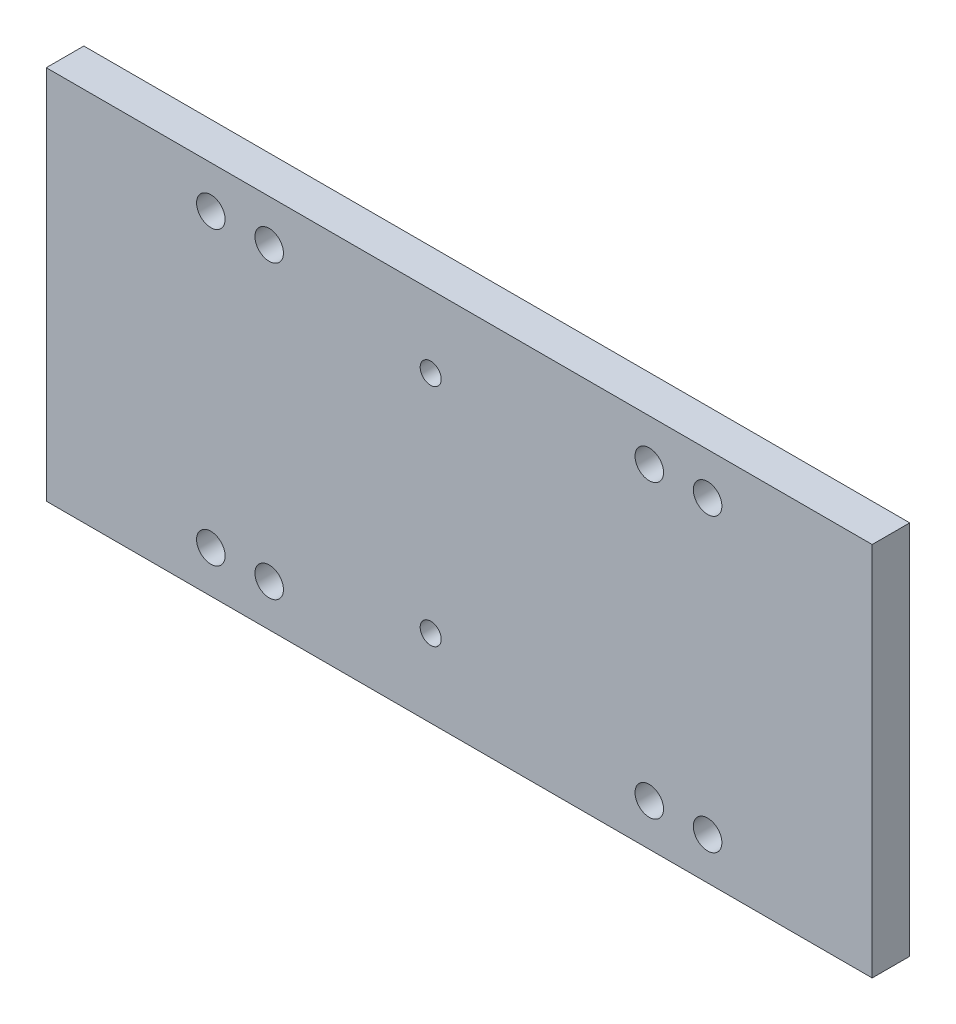
ISO-10303-21;
HEADER;
FILE_DESCRIPTION(('STEP AP214'),'2;1');
FILE_NAME('part.step','',(''),(''),'','','');
FILE_SCHEMA(('AUTOMOTIVE_DESIGN { 1 0 10303 214 1 1 1 1 }'));
ENDSEC;
DATA;
#1=APPLICATION_CONTEXT('core data for automotive mechanical design processes');
#2=APPLICATION_PROTOCOL_DEFINITION('international standard','automotive_design',2000,#1);
#3=PRODUCT_CONTEXT('',#1,'mechanical');
#4=PRODUCT('Part','Part','',(#3));
#5=PRODUCT_RELATED_PRODUCT_CATEGORY('part','',(#4));
#6=PRODUCT_DEFINITION_FORMATION('','',#4);
#7=PRODUCT_DEFINITION_CONTEXT('part definition',#1,'design');
#8=PRODUCT_DEFINITION('design','',#6,#7);
#9=PRODUCT_DEFINITION_SHAPE('','',#8);
#10=(LENGTH_UNIT() NAMED_UNIT(*) SI_UNIT(.MILLI.,.METRE.));
#11=(NAMED_UNIT(*) PLANE_ANGLE_UNIT() SI_UNIT($,.RADIAN.));
#12=(NAMED_UNIT(*) SI_UNIT($,.STERADIAN.) SOLID_ANGLE_UNIT());
#13=UNCERTAINTY_MEASURE_WITH_UNIT(LENGTH_MEASURE(1.E-05),#10,'distance_accuracy_value','');
#14=(GEOMETRIC_REPRESENTATION_CONTEXT(3) GLOBAL_UNCERTAINTY_ASSIGNED_CONTEXT((#13)) GLOBAL_UNIT_ASSIGNED_CONTEXT((#10,
#11,#12)) REPRESENTATION_CONTEXT('',''));
#15=CARTESIAN_POINT('',(0.,0.,0.));
#16=DIRECTION('',(0.,0.,1.));
#17=DIRECTION('',(1.,0.,0.));
#18=AXIS2_PLACEMENT_3D('',#15,#16,#17);
#19=CARTESIAN_POINT('',(0.,0.,6.35));
#20=DIRECTION('',(1.,0.,0.));
#21=DIRECTION('',(0.,0.,-1.));
#22=AXIS2_PLACEMENT_3D('',#19,#20,#21);
#23=PLANE('',#22);
#24=DIRECTION('',(0.,-1.,0.));
#25=VECTOR('',#24,1.);
#26=CARTESIAN_POINT('',(0.,0.,0.));
#27=LINE('',#26,#25);
#28=CARTESIAN_POINT('',(0.,63.5,0.));
#29=VERTEX_POINT('',#28);
#30=CARTESIAN_POINT('',(0.,0.,0.));
#31=VERTEX_POINT('',#30);
#32=EDGE_CURVE('E102',#29,#31,#27,.T.);
#33=ORIENTED_EDGE('',*,*,#32,.T.);
#34=DIRECTION('',(0.,0.,-1.));
#35=VECTOR('',#34,1.);
#36=CARTESIAN_POINT('',(0.,0.,6.35));
#37=LINE('',#36,#35);
#38=CARTESIAN_POINT('',(0.,0.,6.35));
#39=VERTEX_POINT('',#38);
#40=EDGE_CURVE('E11',#39,#31,#37,.T.);
#41=ORIENTED_EDGE('',*,*,#40,.F.);
#42=DIRECTION('',(0.,-1.,0.));
#43=VECTOR('',#42,1.);
#44=CARTESIAN_POINT('',(0.,0.,6.35));
#45=LINE('',#44,#43);
#46=CARTESIAN_POINT('',(0.,63.5,6.35));
#47=VERTEX_POINT('',#46);
#48=EDGE_CURVE('E90',#47,#39,#45,.T.);
#49=ORIENTED_EDGE('',*,*,#48,.F.);
#50=DIRECTION('',(0.,0.,-1.));
#51=VECTOR('',#50,1.);
#52=CARTESIAN_POINT('',(0.,63.5,6.35));
#53=LINE('',#52,#51);
#54=EDGE_CURVE('E98',#47,#29,#53,.T.);
#55=ORIENTED_EDGE('',*,*,#54,.T.);
#56=EDGE_LOOP('',(#33,#41,#49,#55));
#57=FACE_BOUND('',#56,.T.);
#58=ADVANCED_FACE('F39',(#57),#23,.F.);
#59=CARTESIAN_POINT('',(0.,0.,6.35));
#60=DIRECTION('',(0.,1.,0.));
#61=DIRECTION('',(0.,0.,1.));
#62=AXIS2_PLACEMENT_3D('',#59,#60,#61);
#63=PLANE('',#62);
#64=DIRECTION('',(1.,0.,0.));
#65=VECTOR('',#64,1.);
#66=CARTESIAN_POINT('',(0.,0.,0.));
#67=LINE('',#66,#65);
#68=CARTESIAN_POINT('',(139.7,0.,0.));
#69=VERTEX_POINT('',#68);
#70=EDGE_CURVE('E94',#31,#69,#67,.T.);
#71=ORIENTED_EDGE('',*,*,#70,.T.);
#72=DIRECTION('',(0.,0.,-1.));
#73=VECTOR('',#72,1.);
#74=CARTESIAN_POINT('',(139.7,0.,6.35));
#75=LINE('',#74,#73);
#76=CARTESIAN_POINT('',(139.7,0.,6.35));
#77=VERTEX_POINT('',#76);
#78=EDGE_CURVE('E47',#77,#69,#75,.T.);
#79=ORIENTED_EDGE('',*,*,#78,.F.);
#80=DIRECTION('',(1.,0.,0.));
#81=VECTOR('',#80,1.);
#82=CARTESIAN_POINT('',(0.,0.,6.35));
#83=LINE('',#82,#81);
#84=EDGE_CURVE('E85',#39,#77,#83,.T.);
#85=ORIENTED_EDGE('',*,*,#84,.F.);
#86=ORIENTED_EDGE('',*,*,#40,.T.);
#87=EDGE_LOOP('',(#71,#79,#85,#86));
#88=FACE_BOUND('',#87,.T.);
#89=ADVANCED_FACE('F93',(#88),#63,.F.);
#90=CARTESIAN_POINT('',(139.7,0.,6.35));
#91=DIRECTION('',(-1.,0.,0.));
#92=DIRECTION('',(0.,0.,1.));
#93=AXIS2_PLACEMENT_3D('',#90,#91,#92);
#94=PLANE('',#93);
#95=DIRECTION('',(0.,1.,0.));
#96=VECTOR('',#95,1.);
#97=CARTESIAN_POINT('',(139.7,0.,0.));
#98=LINE('',#97,#96);
#99=CARTESIAN_POINT('',(139.7,63.5,0.));
#100=VERTEX_POINT('',#99);
#101=EDGE_CURVE('E72',#69,#100,#98,.T.);
#102=ORIENTED_EDGE('',*,*,#101,.T.);
#103=DIRECTION('',(0.,0.,-1.));
#104=VECTOR('',#103,1.);
#105=CARTESIAN_POINT('',(139.7,63.5,6.35));
#106=LINE('',#105,#104);
#107=CARTESIAN_POINT('',(139.7,63.5,6.35));
#108=VERTEX_POINT('',#107);
#109=EDGE_CURVE('E95',#108,#100,#106,.T.);
#110=ORIENTED_EDGE('',*,*,#109,.F.);
#111=DIRECTION('',(0.,1.,0.));
#112=VECTOR('',#111,1.);
#113=CARTESIAN_POINT('',(139.7,0.,6.35));
#114=LINE('',#113,#112);
#115=EDGE_CURVE('E88',#77,#108,#114,.T.);
#116=ORIENTED_EDGE('',*,*,#115,.F.);
#117=ORIENTED_EDGE('',*,*,#78,.T.);
#118=EDGE_LOOP('',(#102,#110,#116,#117));
#119=FACE_BOUND('',#118,.T.);
#120=ADVANCED_FACE('F96',(#119),#94,.F.);
#121=CARTESIAN_POINT('',(0.,63.5,6.35));
#122=DIRECTION('',(0.,-1.,0.));
#123=DIRECTION('',(0.,0.,-1.));
#124=AXIS2_PLACEMENT_3D('',#121,#122,#123);
#125=PLANE('',#124);
#126=DIRECTION('',(-1.,0.,0.));
#127=VECTOR('',#126,1.);
#128=CARTESIAN_POINT('',(0.,63.5,0.));
#129=LINE('',#128,#127);
#130=EDGE_CURVE('E78',#100,#29,#129,.T.);
#131=ORIENTED_EDGE('',*,*,#130,.T.);
#132=ORIENTED_EDGE('',*,*,#54,.F.);
#133=DIRECTION('',(-1.,0.,0.));
#134=VECTOR('',#133,1.);
#135=CARTESIAN_POINT('',(0.,63.5,6.35));
#136=LINE('',#135,#134);
#137=EDGE_CURVE('E55',#108,#47,#136,.T.);
#138=ORIENTED_EDGE('',*,*,#137,.F.);
#139=ORIENTED_EDGE('',*,*,#109,.T.);
#140=EDGE_LOOP('',(#131,#132,#138,#139));
#141=FACE_BOUND('',#140,.T.);
#142=ADVANCED_FACE('F110',(#141),#125,.F.);
#143=CARTESIAN_POINT('',(0.,0.,6.35));
#144=DIRECTION('',(0.,0.,-1.));
#145=DIRECTION('',(-1.,0.,0.));
#146=AXIS2_PLACEMENT_3D('',#143,#144,#145);
#147=PLANE('',#146);
#148=CARTESIAN_POINT('',(37.7049999999239,56.4,6.35));
#149=DIRECTION('',(0.,0.,-1.));
#150=DIRECTION('',(-1.,0.,0.));
#151=AXIS2_PLACEMENT_3D('',#148,#149,#150);
#152=CIRCLE('',#151,2.41299999999999);
#153=CARTESIAN_POINT('',(35.291999999924,56.4,6.35));
#154=VERTEX_POINT('',#153);
#155=EDGE_CURVE('E146',#154,#154,#152,.F.);
#156=ORIENTED_EDGE('',*,*,#155,.F.);
#157=EDGE_LOOP('',(#156));
#158=FACE_BOUND('',#157,.T.);
#159=CARTESIAN_POINT('',(101.995,56.4,6.35));
#160=DIRECTION('',(0.,0.,-1.));
#161=DIRECTION('',(-1.,0.,0.));
#162=AXIS2_PLACEMENT_3D('',#159,#160,#161);
#163=CIRCLE('',#162,2.41299999999999);
#164=CARTESIAN_POINT('',(99.582,56.4,6.35));
#165=VERTEX_POINT('',#164);
#166=EDGE_CURVE('E141',#165,#165,#163,.F.);
#167=ORIENTED_EDGE('',*,*,#166,.F.);
#168=EDGE_LOOP('',(#167));
#169=FACE_BOUND('',#168,.T.);
#170=CARTESIAN_POINT('',(111.865,56.4,6.35));
#171=DIRECTION('',(0.,0.,-1.));
#172=DIRECTION('',(-1.,0.,0.));
#173=AXIS2_PLACEMENT_3D('',#170,#171,#172);
#174=CIRCLE('',#173,2.41299999999999);
#175=CARTESIAN_POINT('',(109.452,56.4,6.35));
#176=VERTEX_POINT('',#175);
#177=EDGE_CURVE('E134',#176,#176,#174,.F.);
#178=ORIENTED_EDGE('',*,*,#177,.F.);
#179=EDGE_LOOP('',(#178));
#180=FACE_BOUND('',#179,.T.);
#181=CARTESIAN_POINT('',(101.995,7.1,6.35));
#182=DIRECTION('',(0.,0.,-1.));
#183=DIRECTION('',(-1.,0.,0.));
#184=AXIS2_PLACEMENT_3D('',#181,#182,#183);
#185=CIRCLE('',#184,2.413);
#186=CARTESIAN_POINT('',(99.582,7.1,6.35));
#187=VERTEX_POINT('',#186);
#188=EDGE_CURVE('E133',#187,#187,#185,.F.);
#189=ORIENTED_EDGE('',*,*,#188,.F.);
#190=EDGE_LOOP('',(#189));
#191=FACE_BOUND('',#190,.T.);
#192=CARTESIAN_POINT('',(27.834999999924,56.4,6.35));
#193=DIRECTION('',(0.,0.,-1.));
#194=DIRECTION('',(-1.,0.,0.));
#195=AXIS2_PLACEMENT_3D('',#192,#193,#194);
#196=CIRCLE('',#195,2.413);
#197=CARTESIAN_POINT('',(25.421999999924,56.4,6.35));
#198=VERTEX_POINT('',#197);
#199=EDGE_CURVE('E153',#198,#198,#196,.F.);
#200=ORIENTED_EDGE('',*,*,#199,.F.);
#201=EDGE_LOOP('',(#200));
#202=FACE_BOUND('',#201,.T.);
#203=CARTESIAN_POINT('',(27.834999999924,7.1,6.35));
#204=DIRECTION('',(0.,0.,-1.));
#205=DIRECTION('',(-1.,0.,0.));
#206=AXIS2_PLACEMENT_3D('',#203,#204,#205);
#207=CIRCLE('',#206,2.413);
#208=CARTESIAN_POINT('',(25.421999999924,7.1,6.35));
#209=VERTEX_POINT('',#208);
#210=EDGE_CURVE('E165',#209,#209,#207,.F.);
#211=ORIENTED_EDGE('',*,*,#210,.F.);
#212=EDGE_LOOP('',(#211));
#213=FACE_BOUND('',#212,.T.);
#214=CARTESIAN_POINT('',(37.704999999924,7.1,6.35));
#215=DIRECTION('',(0.,0.,-1.));
#216=DIRECTION('',(-1.,0.,0.));
#217=AXIS2_PLACEMENT_3D('',#214,#215,#216);
#218=CIRCLE('',#217,2.413);
#219=CARTESIAN_POINT('',(35.291999999924,7.1,6.35));
#220=VERTEX_POINT('',#219);
#221=EDGE_CURVE('E158',#220,#220,#218,.F.);
#222=ORIENTED_EDGE('',*,*,#221,.F.);
#223=EDGE_LOOP('',(#222));
#224=FACE_BOUND('',#223,.T.);
#225=CARTESIAN_POINT('',(111.865,7.1,6.35));
#226=DIRECTION('',(0.,0.,-1.));
#227=DIRECTION('',(-1.,0.,0.));
#228=AXIS2_PLACEMENT_3D('',#225,#226,#227);
#229=CIRCLE('',#228,2.413);
#230=CARTESIAN_POINT('',(109.452,7.1,6.35));
#231=VERTEX_POINT('',#230);
#232=EDGE_CURVE('E123',#231,#231,#229,.F.);
#233=ORIENTED_EDGE('',*,*,#232,.F.);
#234=EDGE_LOOP('',(#233));
#235=FACE_BOUND('',#234,.T.);
#236=CARTESIAN_POINT('',(65.0239999999997,13.15775,6.35));
#237=DIRECTION('',(0.,0.,-1.));
#238=DIRECTION('',(-1.,0.,0.));
#239=AXIS2_PLACEMENT_3D('',#236,#237,#238);
#240=CIRCLE('',#239,1.77799999999999);
#241=CARTESIAN_POINT('',(63.2459999999997,13.15775,6.35));
#242=VERTEX_POINT('',#241);
#243=EDGE_CURVE('E105',#242,#242,#240,.F.);
#244=ORIENTED_EDGE('',*,*,#243,.F.);
#245=EDGE_LOOP('',(#244));
#246=FACE_BOUND('',#245,.T.);
#247=CARTESIAN_POINT('',(65.0239999999997,51.25775,6.35));
#248=DIRECTION('',(0.,0.,-1.));
#249=DIRECTION('',(-1.,0.,0.));
#250=AXIS2_PLACEMENT_3D('',#247,#248,#249);
#251=CIRCLE('',#250,1.77799999999999);
#252=CARTESIAN_POINT('',(63.2459999999998,51.25775,6.35));
#253=VERTEX_POINT('',#252);
#254=EDGE_CURVE('E120',#253,#253,#251,.F.);
#255=ORIENTED_EDGE('',*,*,#254,.F.);
#256=EDGE_LOOP('',(#255));
#257=FACE_BOUND('',#256,.T.);
#258=ORIENTED_EDGE('',*,*,#48,.T.);
#259=ORIENTED_EDGE('',*,*,#84,.T.);
#260=ORIENTED_EDGE('',*,*,#115,.T.);
#261=ORIENTED_EDGE('',*,*,#137,.T.);
#262=EDGE_LOOP('',(#258,#259,#260,#261));
#263=FACE_BOUND('',#262,.T.);
#264=ADVANCED_FACE('F86',(#158,#169,#180,#191,#202,#213,#224,#235,#246,#257,#263),#147,.F.);
#265=CARTESIAN_POINT('',(0.,0.,0.));
#266=DIRECTION('',(0.,0.,-1.));
#267=DIRECTION('',(-1.,0.,0.));
#268=AXIS2_PLACEMENT_3D('',#265,#266,#267);
#269=PLANE('',#268);
#270=CARTESIAN_POINT('',(37.7049999999239,56.4,0.));
#271=DIRECTION('',(0.,0.,-1.));
#272=DIRECTION('',(-1.,0.,0.));
#273=AXIS2_PLACEMENT_3D('',#270,#271,#272);
#274=CIRCLE('',#273,2.41299999999999);
#275=CARTESIAN_POINT('',(35.291999999924,56.4,0.));
#276=VERTEX_POINT('',#275);
#277=EDGE_CURVE('E150',#276,#276,#274,.T.);
#278=ORIENTED_EDGE('',*,*,#277,.F.);
#279=EDGE_LOOP('',(#278));
#280=FACE_BOUND('',#279,.T.);
#281=CARTESIAN_POINT('',(101.995,56.4,0.));
#282=DIRECTION('',(0.,0.,-1.));
#283=DIRECTION('',(-1.,0.,0.));
#284=AXIS2_PLACEMENT_3D('',#281,#282,#283);
#285=CIRCLE('',#284,2.41299999999999);
#286=CARTESIAN_POINT('',(99.582,56.4,0.));
#287=VERTEX_POINT('',#286);
#288=EDGE_CURVE('E149',#287,#287,#285,.T.);
#289=ORIENTED_EDGE('',*,*,#288,.F.);
#290=EDGE_LOOP('',(#289));
#291=FACE_BOUND('',#290,.T.);
#292=CARTESIAN_POINT('',(111.865,56.4,0.));
#293=DIRECTION('',(0.,0.,-1.));
#294=DIRECTION('',(-1.,0.,0.));
#295=AXIS2_PLACEMENT_3D('',#292,#293,#294);
#296=CIRCLE('',#295,2.41299999999999);
#297=CARTESIAN_POINT('',(109.452,56.4,0.));
#298=VERTEX_POINT('',#297);
#299=EDGE_CURVE('E138',#298,#298,#296,.T.);
#300=ORIENTED_EDGE('',*,*,#299,.F.);
#301=EDGE_LOOP('',(#300));
#302=FACE_BOUND('',#301,.T.);
#303=CARTESIAN_POINT('',(101.995,7.1,0.));
#304=DIRECTION('',(0.,0.,-1.));
#305=DIRECTION('',(-1.,0.,0.));
#306=AXIS2_PLACEMENT_3D('',#303,#304,#305);
#307=CIRCLE('',#306,2.413);
#308=CARTESIAN_POINT('',(99.582,7.1,0.));
#309=VERTEX_POINT('',#308);
#310=EDGE_CURVE('E137',#309,#309,#307,.T.);
#311=ORIENTED_EDGE('',*,*,#310,.F.);
#312=EDGE_LOOP('',(#311));
#313=FACE_BOUND('',#312,.T.);
#314=CARTESIAN_POINT('',(27.834999999924,56.4,0.));
#315=DIRECTION('',(0.,0.,-1.));
#316=DIRECTION('',(-1.,0.,0.));
#317=AXIS2_PLACEMENT_3D('',#314,#315,#316);
#318=CIRCLE('',#317,2.413);
#319=CARTESIAN_POINT('',(25.421999999924,56.4,0.));
#320=VERTEX_POINT('',#319);
#321=EDGE_CURVE('E168',#320,#320,#318,.T.);
#322=ORIENTED_EDGE('',*,*,#321,.F.);
#323=EDGE_LOOP('',(#322));
#324=FACE_BOUND('',#323,.T.);
#325=CARTESIAN_POINT('',(27.834999999924,7.1,0.));
#326=DIRECTION('',(0.,0.,-1.));
#327=DIRECTION('',(-1.,0.,0.));
#328=AXIS2_PLACEMENT_3D('',#325,#326,#327);
#329=CIRCLE('',#328,2.413);
#330=CARTESIAN_POINT('',(25.421999999924,7.1,0.));
#331=VERTEX_POINT('',#330);
#332=EDGE_CURVE('E161',#331,#331,#329,.T.);
#333=ORIENTED_EDGE('',*,*,#332,.F.);
#334=EDGE_LOOP('',(#333));
#335=FACE_BOUND('',#334,.T.);
#336=CARTESIAN_POINT('',(37.704999999924,7.1,0.));
#337=DIRECTION('',(0.,0.,-1.));
#338=DIRECTION('',(-1.,0.,0.));
#339=AXIS2_PLACEMENT_3D('',#336,#337,#338);
#340=CIRCLE('',#339,2.413);
#341=CARTESIAN_POINT('',(35.291999999924,7.1,0.));
#342=VERTEX_POINT('',#341);
#343=EDGE_CURVE('E162',#342,#342,#340,.T.);
#344=ORIENTED_EDGE('',*,*,#343,.F.);
#345=EDGE_LOOP('',(#344));
#346=FACE_BOUND('',#345,.T.);
#347=CARTESIAN_POINT('',(111.865,7.1,0.));
#348=DIRECTION('',(0.,0.,-1.));
#349=DIRECTION('',(-1.,0.,0.));
#350=AXIS2_PLACEMENT_3D('',#347,#348,#349);
#351=CIRCLE('',#350,2.413);
#352=CARTESIAN_POINT('',(109.452,7.1,0.));
#353=VERTEX_POINT('',#352);
#354=EDGE_CURVE('E130',#353,#353,#351,.T.);
#355=ORIENTED_EDGE('',*,*,#354,.F.);
#356=EDGE_LOOP('',(#355));
#357=FACE_BOUND('',#356,.T.);
#358=CARTESIAN_POINT('',(65.0239999999997,13.15775,0.));
#359=DIRECTION('',(0.,0.,-1.));
#360=DIRECTION('',(-1.,0.,0.));
#361=AXIS2_PLACEMENT_3D('',#358,#359,#360);
#362=CIRCLE('',#361,1.77799999999999);
#363=CARTESIAN_POINT('',(63.2459999999997,13.15775,0.));
#364=VERTEX_POINT('',#363);
#365=EDGE_CURVE('E119',#364,#364,#362,.T.);
#366=ORIENTED_EDGE('',*,*,#365,.F.);
#367=EDGE_LOOP('',(#366));
#368=FACE_BOUND('',#367,.T.);
#369=CARTESIAN_POINT('',(65.0239999999997,51.25775,0.));
#370=DIRECTION('',(0.,0.,-1.));
#371=DIRECTION('',(-1.,0.,0.));
#372=AXIS2_PLACEMENT_3D('',#369,#370,#371);
#373=CIRCLE('',#372,1.77799999999999);
#374=CARTESIAN_POINT('',(63.2459999999998,51.25775,0.));
#375=VERTEX_POINT('',#374);
#376=EDGE_CURVE('E116',#375,#375,#373,.T.);
#377=ORIENTED_EDGE('',*,*,#376,.F.);
#378=EDGE_LOOP('',(#377));
#379=FACE_BOUND('',#378,.T.);
#380=ORIENTED_EDGE('',*,*,#32,.F.);
#381=ORIENTED_EDGE('',*,*,#130,.F.);
#382=ORIENTED_EDGE('',*,*,#101,.F.);
#383=ORIENTED_EDGE('',*,*,#70,.F.);
#384=EDGE_LOOP('',(#380,#381,#382,#383));
#385=FACE_BOUND('',#384,.T.);
#386=ADVANCED_FACE('F113',(#280,#291,#302,#313,#324,#335,#346,#357,#368,#379,#385),#269,.T.);
#387=CARTESIAN_POINT('',(65.0239999999997,51.25775,11.3789434277987));
#388=DIRECTION('',(0.,0.,-1.));
#389=DIRECTION('',(-1.,0.,0.));
#390=AXIS2_PLACEMENT_3D('',#387,#388,#389);
#391=CYLINDRICAL_SURFACE('',#390,1.77799999999999);
#392=ORIENTED_EDGE('',*,*,#254,.T.);
#393=EDGE_LOOP('',(#392));
#394=FACE_BOUND('',#393,.T.);
#395=ORIENTED_EDGE('',*,*,#376,.T.);
#396=EDGE_LOOP('',(#395));
#397=FACE_BOUND('',#396,.T.);
#398=ADVANCED_FACE('F180',(#394,#397),#391,.F.);
#399=CARTESIAN_POINT('',(65.0239999999997,13.15775,11.3789434277987));
#400=DIRECTION('',(0.,0.,-1.));
#401=DIRECTION('',(-1.,0.,0.));
#402=AXIS2_PLACEMENT_3D('',#399,#400,#401);
#403=CYLINDRICAL_SURFACE('',#402,1.77799999999999);
#404=ORIENTED_EDGE('',*,*,#243,.T.);
#405=EDGE_LOOP('',(#404));
#406=FACE_BOUND('',#405,.T.);
#407=ORIENTED_EDGE('',*,*,#365,.T.);
#408=EDGE_LOOP('',(#407));
#409=FACE_BOUND('',#408,.T.);
#410=ADVANCED_FACE('F194',(#406,#409),#403,.F.);
#411=CARTESIAN_POINT('',(111.865,7.1,13.1749946520126));
#412=DIRECTION('',(0.,0.,-1.));
#413=DIRECTION('',(-1.,0.,0.));
#414=AXIS2_PLACEMENT_3D('',#411,#412,#413);
#415=CYLINDRICAL_SURFACE('',#414,2.413);
#416=ORIENTED_EDGE('',*,*,#232,.T.);
#417=EDGE_LOOP('',(#416));
#418=FACE_BOUND('',#417,.T.);
#419=ORIENTED_EDGE('',*,*,#354,.T.);
#420=EDGE_LOOP('',(#419));
#421=FACE_BOUND('',#420,.T.);
#422=ADVANCED_FACE('F201',(#418,#421),#415,.F.);
#423=CARTESIAN_POINT('',(37.704999999924,7.1,13.1749946520126));
#424=DIRECTION('',(0.,0.,-1.));
#425=DIRECTION('',(-1.,0.,0.));
#426=AXIS2_PLACEMENT_3D('',#423,#424,#425);
#427=CYLINDRICAL_SURFACE('',#426,2.413);
#428=ORIENTED_EDGE('',*,*,#221,.T.);
#429=EDGE_LOOP('',(#428));
#430=FACE_BOUND('',#429,.T.);
#431=ORIENTED_EDGE('',*,*,#343,.T.);
#432=EDGE_LOOP('',(#431));
#433=FACE_BOUND('',#432,.T.);
#434=ADVANCED_FACE('F243',(#430,#433),#427,.F.);
#435=CARTESIAN_POINT('',(27.834999999924,7.1,13.1749946520126));
#436=DIRECTION('',(0.,0.,-1.));
#437=DIRECTION('',(-1.,0.,0.));
#438=AXIS2_PLACEMENT_3D('',#435,#436,#437);
#439=CYLINDRICAL_SURFACE('',#438,2.413);
#440=ORIENTED_EDGE('',*,*,#210,.T.);
#441=EDGE_LOOP('',(#440));
#442=FACE_BOUND('',#441,.T.);
#443=ORIENTED_EDGE('',*,*,#332,.T.);
#444=EDGE_LOOP('',(#443));
#445=FACE_BOUND('',#444,.T.);
#446=ADVANCED_FACE('F248',(#442,#445),#439,.F.);
#447=CARTESIAN_POINT('',(27.834999999924,56.4,13.1749946520126));
#448=DIRECTION('',(0.,0.,-1.));
#449=DIRECTION('',(-1.,0.,0.));
#450=AXIS2_PLACEMENT_3D('',#447,#448,#449);
#451=CYLINDRICAL_SURFACE('',#450,2.413);
#452=ORIENTED_EDGE('',*,*,#199,.T.);
#453=EDGE_LOOP('',(#452));
#454=FACE_BOUND('',#453,.T.);
#455=ORIENTED_EDGE('',*,*,#321,.T.);
#456=EDGE_LOOP('',(#455));
#457=FACE_BOUND('',#456,.T.);
#458=ADVANCED_FACE('F176',(#454,#457),#451,.F.);
#459=CARTESIAN_POINT('',(101.995,7.1,13.1749946520126));
#460=DIRECTION('',(0.,0.,-1.));
#461=DIRECTION('',(-1.,0.,0.));
#462=AXIS2_PLACEMENT_3D('',#459,#460,#461);
#463=CYLINDRICAL_SURFACE('',#462,2.413);
#464=ORIENTED_EDGE('',*,*,#188,.T.);
#465=EDGE_LOOP('',(#464));
#466=FACE_BOUND('',#465,.T.);
#467=ORIENTED_EDGE('',*,*,#310,.T.);
#468=EDGE_LOOP('',(#467));
#469=FACE_BOUND('',#468,.T.);
#470=ADVANCED_FACE('F256',(#466,#469),#463,.F.);
#471=CARTESIAN_POINT('',(111.865,56.4,13.1749946520126));
#472=DIRECTION('',(0.,0.,-1.));
#473=DIRECTION('',(-1.,0.,0.));
#474=AXIS2_PLACEMENT_3D('',#471,#472,#473);
#475=CYLINDRICAL_SURFACE('',#474,2.41299999999999);
#476=ORIENTED_EDGE('',*,*,#177,.T.);
#477=EDGE_LOOP('',(#476));
#478=FACE_BOUND('',#477,.T.);
#479=ORIENTED_EDGE('',*,*,#299,.T.);
#480=EDGE_LOOP('',(#479));
#481=FACE_BOUND('',#480,.T.);
#482=ADVANCED_FACE('F252',(#478,#481),#475,.F.);
#483=CARTESIAN_POINT('',(101.995,56.4,13.1749946520126));
#484=DIRECTION('',(0.,0.,-1.));
#485=DIRECTION('',(-1.,0.,0.));
#486=AXIS2_PLACEMENT_3D('',#483,#484,#485);
#487=CYLINDRICAL_SURFACE('',#486,2.41299999999999);
#488=ORIENTED_EDGE('',*,*,#166,.T.);
#489=EDGE_LOOP('',(#488));
#490=FACE_BOUND('',#489,.T.);
#491=ORIENTED_EDGE('',*,*,#288,.T.);
#492=EDGE_LOOP('',(#491));
#493=FACE_BOUND('',#492,.T.);
#494=ADVANCED_FACE('F255',(#490,#493),#487,.F.);
#495=CARTESIAN_POINT('',(37.7049999999239,56.4,13.1749946520126));
#496=DIRECTION('',(0.,0.,-1.));
#497=DIRECTION('',(-1.,0.,0.));
#498=AXIS2_PLACEMENT_3D('',#495,#496,#497);
#499=CYLINDRICAL_SURFACE('',#498,2.41299999999999);
#500=ORIENTED_EDGE('',*,*,#155,.T.);
#501=EDGE_LOOP('',(#500));
#502=FACE_BOUND('',#501,.T.);
#503=ORIENTED_EDGE('',*,*,#277,.T.);
#504=EDGE_LOOP('',(#503));
#505=FACE_BOUND('',#504,.T.);
#506=ADVANCED_FACE('F261',(#502,#505),#499,.F.);
#507=CLOSED_SHELL('',(#58,#89,#120,#142,#264,#386,#398,#410,#422,#434,#446,#458,#470,#482,#494,#506));
#508=MANIFOLD_SOLID_BREP('B2',#507);
#509=ADVANCED_BREP_SHAPE_REPRESENTATION('',(#18,#508),#14);
#510=SHAPE_DEFINITION_REPRESENTATION(#9,#509);
ENDSEC;
END-ISO-10303-21;
